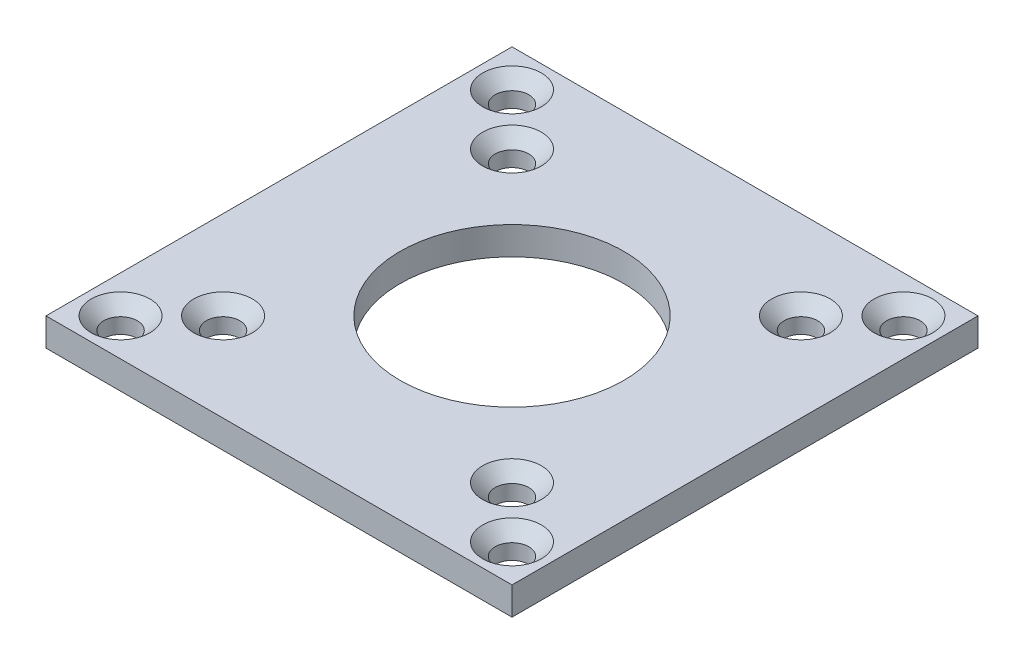
ISO-10303-21;
HEADER;
FILE_DESCRIPTION(('STEP AP214'),'2;1');
FILE_NAME('part.step','',(''),(''),'','','');
FILE_SCHEMA(('AUTOMOTIVE_DESIGN { 1 0 10303 214 1 1 1 1 }'));
ENDSEC;
DATA;
#1=APPLICATION_CONTEXT('core data for automotive mechanical design processes');
#2=APPLICATION_PROTOCOL_DEFINITION('international standard','automotive_design',2000,#1);
#3=PRODUCT_CONTEXT('',#1,'mechanical');
#4=PRODUCT('Part','Part','',(#3));
#5=PRODUCT_RELATED_PRODUCT_CATEGORY('part','',(#4));
#6=PRODUCT_DEFINITION_FORMATION('','',#4);
#7=PRODUCT_DEFINITION_CONTEXT('part definition',#1,'design');
#8=PRODUCT_DEFINITION('design','',#6,#7);
#9=PRODUCT_DEFINITION_SHAPE('','',#8);
#10=(LENGTH_UNIT() NAMED_UNIT(*) SI_UNIT(.MILLI.,.METRE.));
#11=(NAMED_UNIT(*) PLANE_ANGLE_UNIT() SI_UNIT($,.RADIAN.));
#12=(NAMED_UNIT(*) SI_UNIT($,.STERADIAN.) SOLID_ANGLE_UNIT());
#13=UNCERTAINTY_MEASURE_WITH_UNIT(LENGTH_MEASURE(1.E-05),#10,'distance_accuracy_value','');
#14=(GEOMETRIC_REPRESENTATION_CONTEXT(3) GLOBAL_UNCERTAINTY_ASSIGNED_CONTEXT((#13)) GLOBAL_UNIT_ASSIGNED_CONTEXT((#10,
#11,#12)) REPRESENTATION_CONTEXT('',''));
#15=CARTESIAN_POINT('',(0.,0.,0.));
#16=DIRECTION('',(0.,0.,1.));
#17=DIRECTION('',(1.,0.,0.));
#18=AXIS2_PLACEMENT_3D('',#15,#16,#17);
#19=CARTESIAN_POINT('',(-25.,3.,25.));
#20=DIRECTION('',(1.,0.,0.));
#21=DIRECTION('',(0.,0.,-1.));
#22=AXIS2_PLACEMENT_3D('',#19,#20,#21);
#23=PLANE('',#22);
#24=DIRECTION('',(0.,0.,1.));
#25=VECTOR('',#24,1.);
#26=CARTESIAN_POINT('',(-25.,0.,25.));
#27=LINE('',#26,#25);
#28=CARTESIAN_POINT('',(-25.,0.,-25.));
#29=VERTEX_POINT('',#28);
#30=CARTESIAN_POINT('',(-25.,0.,25.));
#31=VERTEX_POINT('',#30);
#32=EDGE_CURVE('E107',#29,#31,#27,.T.);
#33=ORIENTED_EDGE('',*,*,#32,.T.);
#34=DIRECTION('',(0.,-1.,0.));
#35=VECTOR('',#34,1.);
#36=CARTESIAN_POINT('',(-25.,3.,25.));
#37=LINE('',#36,#35);
#38=CARTESIAN_POINT('',(-25.,3.,25.));
#39=VERTEX_POINT('',#38);
#40=EDGE_CURVE('E11',#39,#31,#37,.T.);
#41=ORIENTED_EDGE('',*,*,#40,.F.);
#42=DIRECTION('',(0.,0.,1.));
#43=VECTOR('',#42,1.);
#44=CARTESIAN_POINT('',(-25.,3.,25.));
#45=LINE('',#44,#43);
#46=CARTESIAN_POINT('',(-25.,3.,-25.));
#47=VERTEX_POINT('',#46);
#48=EDGE_CURVE('E91',#47,#39,#45,.T.);
#49=ORIENTED_EDGE('',*,*,#48,.F.);
#50=DIRECTION('',(0.,-1.,0.));
#51=VECTOR('',#50,1.);
#52=CARTESIAN_POINT('',(-25.,3.,-25.));
#53=LINE('',#52,#51);
#54=EDGE_CURVE('E103',#47,#29,#53,.T.);
#55=ORIENTED_EDGE('',*,*,#54,.T.);
#56=EDGE_LOOP('',(#33,#41,#49,#55));
#57=FACE_BOUND('',#56,.T.);
#58=ADVANCED_FACE('F39',(#57),#23,.F.);
#59=CARTESIAN_POINT('',(25.,3.,25.));
#60=DIRECTION('',(0.,0.,-1.));
#61=DIRECTION('',(-1.,0.,0.));
#62=AXIS2_PLACEMENT_3D('',#59,#60,#61);
#63=PLANE('',#62);
#64=DIRECTION('',(1.,0.,0.));
#65=VECTOR('',#64,1.);
#66=CARTESIAN_POINT('',(25.,0.,25.));
#67=LINE('',#66,#65);
#68=CARTESIAN_POINT('',(25.,0.,25.));
#69=VERTEX_POINT('',#68);
#70=EDGE_CURVE('E96',#31,#69,#67,.T.);
#71=ORIENTED_EDGE('',*,*,#70,.T.);
#72=DIRECTION('',(0.,-1.,0.));
#73=VECTOR('',#72,1.);
#74=CARTESIAN_POINT('',(25.,3.,25.));
#75=LINE('',#74,#73);
#76=CARTESIAN_POINT('',(25.,3.,25.));
#77=VERTEX_POINT('',#76);
#78=EDGE_CURVE('E48',#77,#69,#75,.T.);
#79=ORIENTED_EDGE('',*,*,#78,.F.);
#80=DIRECTION('',(1.,0.,0.));
#81=VECTOR('',#80,1.);
#82=CARTESIAN_POINT('',(25.,3.,25.));
#83=LINE('',#82,#81);
#84=EDGE_CURVE('E86',#39,#77,#83,.T.);
#85=ORIENTED_EDGE('',*,*,#84,.F.);
#86=ORIENTED_EDGE('',*,*,#40,.T.);
#87=EDGE_LOOP('',(#71,#79,#85,#86));
#88=FACE_BOUND('',#87,.T.);
#89=ADVANCED_FACE('F95',(#88),#63,.F.);
#90=CARTESIAN_POINT('',(25.,3.,25.));
#91=DIRECTION('',(-1.,0.,0.));
#92=DIRECTION('',(0.,0.,1.));
#93=AXIS2_PLACEMENT_3D('',#90,#91,#92);
#94=PLANE('',#93);
#95=DIRECTION('',(0.,0.,-1.));
#96=VECTOR('',#95,1.);
#97=CARTESIAN_POINT('',(25.,0.,25.));
#98=LINE('',#97,#96);
#99=CARTESIAN_POINT('',(25.,0.,-25.));
#100=VERTEX_POINT('',#99);
#101=EDGE_CURVE('E73',#69,#100,#98,.T.);
#102=ORIENTED_EDGE('',*,*,#101,.T.);
#103=DIRECTION('',(0.,-1.,0.));
#104=VECTOR('',#103,1.);
#105=CARTESIAN_POINT('',(25.,3.,-25.));
#106=LINE('',#105,#104);
#107=CARTESIAN_POINT('',(25.,3.,-25.));
#108=VERTEX_POINT('',#107);
#109=EDGE_CURVE('E98',#108,#100,#106,.T.);
#110=ORIENTED_EDGE('',*,*,#109,.F.);
#111=DIRECTION('',(0.,0.,-1.));
#112=VECTOR('',#111,1.);
#113=CARTESIAN_POINT('',(25.,3.,25.));
#114=LINE('',#113,#112);
#115=EDGE_CURVE('E89',#77,#108,#114,.T.);
#116=ORIENTED_EDGE('',*,*,#115,.F.);
#117=ORIENTED_EDGE('',*,*,#78,.T.);
#118=EDGE_LOOP('',(#102,#110,#116,#117));
#119=FACE_BOUND('',#118,.T.);
#120=ADVANCED_FACE('F99',(#119),#94,.F.);
#121=CARTESIAN_POINT('',(25.,3.,-25.));
#122=DIRECTION('',(0.,0.,1.));
#123=DIRECTION('',(1.,0.,0.));
#124=AXIS2_PLACEMENT_3D('',#121,#122,#123);
#125=PLANE('',#124);
#126=DIRECTION('',(-1.,0.,0.));
#127=VECTOR('',#126,1.);
#128=CARTESIAN_POINT('',(25.,0.,-25.));
#129=LINE('',#128,#127);
#130=EDGE_CURVE('E79',#100,#29,#129,.T.);
#131=ORIENTED_EDGE('',*,*,#130,.T.);
#132=ORIENTED_EDGE('',*,*,#54,.F.);
#133=DIRECTION('',(-1.,0.,0.));
#134=VECTOR('',#133,1.);
#135=CARTESIAN_POINT('',(25.,3.,-25.));
#136=LINE('',#135,#134);
#137=EDGE_CURVE('E56',#108,#47,#136,.T.);
#138=ORIENTED_EDGE('',*,*,#137,.F.);
#139=ORIENTED_EDGE('',*,*,#109,.T.);
#140=EDGE_LOOP('',(#131,#132,#138,#139));
#141=FACE_BOUND('',#140,.T.);
#142=ADVANCED_FACE('F121',(#141),#125,.F.);
#143=CARTESIAN_POINT('',(0.,3.,0.));
#144=DIRECTION('',(0.,1.,0.));
#145=DIRECTION('',(0.,0.,1.));
#146=AXIS2_PLACEMENT_3D('',#143,#144,#145);
#147=PLANE('',#146);
#148=CARTESIAN_POINT('',(-15.5,3.,-15.5000000000001));
#149=DIRECTION('',(0.,1.,0.));
#150=DIRECTION('',(0.,0.,1.));
#151=AXIS2_PLACEMENT_3D('',#148,#149,#150);
#152=CIRCLE('',#151,3.15);
#153=CARTESIAN_POINT('',(-15.5,3.,-12.3500000000001));
#154=VERTEX_POINT('',#153);
#155=EDGE_CURVE('E227',#154,#154,#152,.T.);
#156=ORIENTED_EDGE('',*,*,#155,.F.);
#157=EDGE_LOOP('',(#156));
#158=FACE_BOUND('',#157,.T.);
#159=CARTESIAN_POINT('',(15.4999999999999,3.,-15.5000000000001));
#160=DIRECTION('',(0.,1.,0.));
#161=DIRECTION('',(0.,0.,1.));
#162=AXIS2_PLACEMENT_3D('',#159,#160,#161);
#163=CIRCLE('',#162,3.15);
#164=CARTESIAN_POINT('',(15.4999999999999,3.,-12.3500000000001));
#165=VERTEX_POINT('',#164);
#166=EDGE_CURVE('E215',#165,#165,#163,.T.);
#167=ORIENTED_EDGE('',*,*,#166,.F.);
#168=EDGE_LOOP('',(#167));
#169=FACE_BOUND('',#168,.T.);
#170=CARTESIAN_POINT('',(15.4999999999999,3.,15.4999999999999));
#171=DIRECTION('',(0.,1.,0.));
#172=DIRECTION('',(0.,0.,1.));
#173=AXIS2_PLACEMENT_3D('',#170,#171,#172);
#174=CIRCLE('',#173,3.15);
#175=CARTESIAN_POINT('',(15.4999999999999,3.,18.6499999999999));
#176=VERTEX_POINT('',#175);
#177=EDGE_CURVE('E203',#176,#176,#174,.T.);
#178=ORIENTED_EDGE('',*,*,#177,.F.);
#179=EDGE_LOOP('',(#178));
#180=FACE_BOUND('',#179,.T.);
#181=CARTESIAN_POINT('',(-15.5,3.,15.4999999999999));
#182=DIRECTION('',(0.,1.,0.));
#183=DIRECTION('',(0.,0.,1.));
#184=AXIS2_PLACEMENT_3D('',#181,#182,#183);
#185=CIRCLE('',#184,3.15);
#186=CARTESIAN_POINT('',(-15.5,3.,18.6499999999999));
#187=VERTEX_POINT('',#186);
#188=EDGE_CURVE('E191',#187,#187,#185,.T.);
#189=ORIENTED_EDGE('',*,*,#188,.F.);
#190=EDGE_LOOP('',(#189));
#191=FACE_BOUND('',#190,.T.);
#192=CARTESIAN_POINT('',(0.,3.,0.));
#193=DIRECTION('',(0.,1.,0.));
#194=DIRECTION('',(0.,0.,1.));
#195=AXIS2_PLACEMENT_3D('',#192,#193,#194);
#196=CIRCLE('',#195,12.);
#197=CARTESIAN_POINT('',(0.,3.,12.));
#198=VERTEX_POINT('',#197);
#199=EDGE_CURVE('E179',#198,#198,#196,.T.);
#200=ORIENTED_EDGE('',*,*,#199,.F.);
#201=EDGE_LOOP('',(#200));
#202=FACE_BOUND('',#201,.T.);
#203=CARTESIAN_POINT('',(-21.,3.,21.));
#204=DIRECTION('',(0.,1.,0.));
#205=DIRECTION('',(0.,0.,1.));
#206=AXIS2_PLACEMENT_3D('',#203,#204,#205);
#207=CIRCLE('',#206,3.15);
#208=CARTESIAN_POINT('',(-21.,3.,24.15));
#209=VERTEX_POINT('',#208);
#210=EDGE_CURVE('E171',#209,#209,#207,.T.);
#211=ORIENTED_EDGE('',*,*,#210,.F.);
#212=EDGE_LOOP('',(#211));
#213=FACE_BOUND('',#212,.T.);
#214=CARTESIAN_POINT('',(-21.,3.,-21.));
#215=DIRECTION('',(0.,1.,0.));
#216=DIRECTION('',(0.,0.,1.));
#217=AXIS2_PLACEMENT_3D('',#214,#215,#216);
#218=CIRCLE('',#217,3.15);
#219=CARTESIAN_POINT('',(-21.,3.,-17.85));
#220=VERTEX_POINT('',#219);
#221=EDGE_CURVE('E159',#220,#220,#218,.T.);
#222=ORIENTED_EDGE('',*,*,#221,.F.);
#223=EDGE_LOOP('',(#222));
#224=FACE_BOUND('',#223,.T.);
#225=CARTESIAN_POINT('',(21.,3.,-21.));
#226=DIRECTION('',(0.,1.,0.));
#227=DIRECTION('',(0.,0.,1.));
#228=AXIS2_PLACEMENT_3D('',#225,#226,#227);
#229=CIRCLE('',#228,3.15);
#230=CARTESIAN_POINT('',(21.,3.,-17.85));
#231=VERTEX_POINT('',#230);
#232=EDGE_CURVE('E147',#231,#231,#229,.T.);
#233=ORIENTED_EDGE('',*,*,#232,.F.);
#234=EDGE_LOOP('',(#233));
#235=FACE_BOUND('',#234,.T.);
#236=CARTESIAN_POINT('',(21.,3.,21.));
#237=DIRECTION('',(0.,1.,0.));
#238=DIRECTION('',(0.,0.,1.));
#239=AXIS2_PLACEMENT_3D('',#236,#237,#238);
#240=CIRCLE('',#239,3.15);
#241=CARTESIAN_POINT('',(21.,3.,24.15));
#242=VERTEX_POINT('',#241);
#243=EDGE_CURVE('E135',#242,#242,#240,.T.);
#244=ORIENTED_EDGE('',*,*,#243,.F.);
#245=EDGE_LOOP('',(#244));
#246=FACE_BOUND('',#245,.T.);
#247=ORIENTED_EDGE('',*,*,#48,.T.);
#248=ORIENTED_EDGE('',*,*,#84,.T.);
#249=ORIENTED_EDGE('',*,*,#115,.T.);
#250=ORIENTED_EDGE('',*,*,#137,.T.);
#251=EDGE_LOOP('',(#247,#248,#249,#250));
#252=FACE_BOUND('',#251,.T.);
#253=ADVANCED_FACE('F87',(#158,#169,#180,#191,#202,#213,#224,#235,#246,#252),#147,.T.);
#254=CARTESIAN_POINT('',(0.,0.,0.));
#255=DIRECTION('',(0.,1.,0.));
#256=DIRECTION('',(0.,0.,1.));
#257=AXIS2_PLACEMENT_3D('',#254,#255,#256);
#258=PLANE('',#257);
#259=CARTESIAN_POINT('',(-15.5,0.,-15.5000000000001));
#260=DIRECTION('',(0.,1.,0.));
#261=DIRECTION('',(0.,0.,1.));
#262=AXIS2_PLACEMENT_3D('',#259,#260,#261);
#263=CIRCLE('',#262,1.79999999999999);
#264=CARTESIAN_POINT('',(-15.5,0.,-13.7000000000001));
#265=VERTEX_POINT('',#264);
#266=EDGE_CURVE('E219',#265,#265,#263,.T.);
#267=ORIENTED_EDGE('',*,*,#266,.T.);
#268=EDGE_LOOP('',(#267));
#269=FACE_BOUND('',#268,.T.);
#270=CARTESIAN_POINT('',(15.4999999999999,0.,-15.5000000000001));
#271=DIRECTION('',(0.,1.,0.));
#272=DIRECTION('',(0.,0.,1.));
#273=AXIS2_PLACEMENT_3D('',#270,#271,#272);
#274=CIRCLE('',#273,1.79999999999999);
#275=CARTESIAN_POINT('',(15.4999999999999,0.,-13.7000000000001));
#276=VERTEX_POINT('',#275);
#277=EDGE_CURVE('E207',#276,#276,#274,.T.);
#278=ORIENTED_EDGE('',*,*,#277,.T.);
#279=EDGE_LOOP('',(#278));
#280=FACE_BOUND('',#279,.T.);
#281=CARTESIAN_POINT('',(15.4999999999999,0.,15.4999999999999));
#282=DIRECTION('',(0.,1.,0.));
#283=DIRECTION('',(0.,0.,1.));
#284=AXIS2_PLACEMENT_3D('',#281,#282,#283);
#285=CIRCLE('',#284,1.79999999999999);
#286=CARTESIAN_POINT('',(15.4999999999999,0.,17.2999999999999));
#287=VERTEX_POINT('',#286);
#288=EDGE_CURVE('E195',#287,#287,#285,.T.);
#289=ORIENTED_EDGE('',*,*,#288,.T.);
#290=EDGE_LOOP('',(#289));
#291=FACE_BOUND('',#290,.T.);
#292=CARTESIAN_POINT('',(-15.5,0.,15.4999999999999));
#293=DIRECTION('',(0.,1.,0.));
#294=DIRECTION('',(0.,0.,1.));
#295=AXIS2_PLACEMENT_3D('',#292,#293,#294);
#296=CIRCLE('',#295,1.79999999999999);
#297=CARTESIAN_POINT('',(-15.5,0.,17.2999999999999));
#298=VERTEX_POINT('',#297);
#299=EDGE_CURVE('E183',#298,#298,#296,.T.);
#300=ORIENTED_EDGE('',*,*,#299,.T.);
#301=EDGE_LOOP('',(#300));
#302=FACE_BOUND('',#301,.T.);
#303=CARTESIAN_POINT('',(0.,0.,0.));
#304=DIRECTION('',(0.,1.,0.));
#305=DIRECTION('',(0.,0.,1.));
#306=AXIS2_PLACEMENT_3D('',#303,#304,#305);
#307=CIRCLE('',#306,12.);
#308=CARTESIAN_POINT('',(0.,0.,12.));
#309=VERTEX_POINT('',#308);
#310=EDGE_CURVE('E175',#309,#309,#307,.T.);
#311=ORIENTED_EDGE('',*,*,#310,.T.);
#312=EDGE_LOOP('',(#311));
#313=FACE_BOUND('',#312,.T.);
#314=CARTESIAN_POINT('',(-21.,0.,21.));
#315=DIRECTION('',(0.,1.,0.));
#316=DIRECTION('',(0.,0.,1.));
#317=AXIS2_PLACEMENT_3D('',#314,#315,#316);
#318=CIRCLE('',#317,1.8);
#319=CARTESIAN_POINT('',(-21.,0.,22.8));
#320=VERTEX_POINT('',#319);
#321=EDGE_CURVE('E163',#320,#320,#318,.T.);
#322=ORIENTED_EDGE('',*,*,#321,.T.);
#323=EDGE_LOOP('',(#322));
#324=FACE_BOUND('',#323,.T.);
#325=CARTESIAN_POINT('',(-21.,0.,-21.));
#326=DIRECTION('',(0.,1.,0.));
#327=DIRECTION('',(0.,0.,1.));
#328=AXIS2_PLACEMENT_3D('',#325,#326,#327);
#329=CIRCLE('',#328,1.8);
#330=CARTESIAN_POINT('',(-21.,0.,-19.2));
#331=VERTEX_POINT('',#330);
#332=EDGE_CURVE('E151',#331,#331,#329,.T.);
#333=ORIENTED_EDGE('',*,*,#332,.T.);
#334=EDGE_LOOP('',(#333));
#335=FACE_BOUND('',#334,.T.);
#336=CARTESIAN_POINT('',(21.,0.,-21.));
#337=DIRECTION('',(0.,1.,0.));
#338=DIRECTION('',(0.,0.,1.));
#339=AXIS2_PLACEMENT_3D('',#336,#337,#338);
#340=CIRCLE('',#339,1.8);
#341=CARTESIAN_POINT('',(21.,0.,-19.2));
#342=VERTEX_POINT('',#341);
#343=EDGE_CURVE('E139',#342,#342,#340,.T.);
#344=ORIENTED_EDGE('',*,*,#343,.T.);
#345=EDGE_LOOP('',(#344));
#346=FACE_BOUND('',#345,.T.);
#347=CARTESIAN_POINT('',(21.,0.,21.));
#348=DIRECTION('',(0.,1.,0.));
#349=DIRECTION('',(0.,0.,1.));
#350=AXIS2_PLACEMENT_3D('',#347,#348,#349);
#351=CIRCLE('',#350,1.8);
#352=CARTESIAN_POINT('',(21.,0.,22.8));
#353=VERTEX_POINT('',#352);
#354=EDGE_CURVE('E111',#353,#353,#351,.T.);
#355=ORIENTED_EDGE('',*,*,#354,.T.);
#356=EDGE_LOOP('',(#355));
#357=FACE_BOUND('',#356,.T.);
#358=ORIENTED_EDGE('',*,*,#32,.F.);
#359=ORIENTED_EDGE('',*,*,#130,.F.);
#360=ORIENTED_EDGE('',*,*,#101,.F.);
#361=ORIENTED_EDGE('',*,*,#70,.F.);
#362=EDGE_LOOP('',(#358,#359,#360,#361));
#363=FACE_BOUND('',#362,.T.);
#364=ADVANCED_FACE('F124',(#269,#280,#291,#302,#313,#324,#335,#346,#357,#363),#258,.F.);
#365=CARTESIAN_POINT('',(21.,3.,21.));
#366=DIRECTION('',(0.,1.,0.));
#367=DIRECTION('',(0.,0.,1.));
#368=AXIS2_PLACEMENT_3D('',#365,#366,#367);
#369=CYLINDRICAL_SURFACE('',#368,1.8);
#370=ORIENTED_EDGE('',*,*,#354,.F.);
#371=EDGE_LOOP('',(#370));
#372=FACE_BOUND('',#371,.T.);
#373=CARTESIAN_POINT('',(21.,1.65,21.));
#374=DIRECTION('',(0.,1.,0.));
#375=DIRECTION('',(0.,0.,1.));
#376=AXIS2_PLACEMENT_3D('',#373,#374,#375);
#377=CIRCLE('',#376,1.8);
#378=CARTESIAN_POINT('',(21.,1.65,22.8));
#379=VERTEX_POINT('',#378);
#380=EDGE_CURVE('E131',#379,#379,#377,.T.);
#381=ORIENTED_EDGE('',*,*,#380,.T.);
#382=EDGE_LOOP('',(#381));
#383=FACE_BOUND('',#382,.T.);
#384=ADVANCED_FACE('F256',(#372,#383),#369,.F.);
#385=CARTESIAN_POINT('',(21.,3.,21.));
#386=DIRECTION('',(0.,1.,0.));
#387=DIRECTION('',(0.,0.,1.));
#388=AXIS2_PLACEMENT_3D('',#385,#386,#387);
#389=CONICAL_SURFACE('',#388,3.15,0.785398163397448);
#390=ORIENTED_EDGE('',*,*,#380,.F.);
#391=EDGE_LOOP('',(#390));
#392=FACE_BOUND('',#391,.T.);
#393=ORIENTED_EDGE('',*,*,#243,.T.);
#394=EDGE_LOOP('',(#393));
#395=FACE_BOUND('',#394,.T.);
#396=ADVANCED_FACE('F253',(#392,#395),#389,.F.);
#397=CARTESIAN_POINT('',(21.,3.,-21.));
#398=DIRECTION('',(0.,1.,0.));
#399=DIRECTION('',(0.,0.,1.));
#400=AXIS2_PLACEMENT_3D('',#397,#398,#399);
#401=CYLINDRICAL_SURFACE('',#400,1.8);
#402=ORIENTED_EDGE('',*,*,#343,.F.);
#403=EDGE_LOOP('',(#402));
#404=FACE_BOUND('',#403,.T.);
#405=CARTESIAN_POINT('',(21.,1.65,-21.));
#406=DIRECTION('',(0.,1.,0.));
#407=DIRECTION('',(0.,0.,1.));
#408=AXIS2_PLACEMENT_3D('',#405,#406,#407);
#409=CIRCLE('',#408,1.8);
#410=CARTESIAN_POINT('',(21.,1.65,-19.2));
#411=VERTEX_POINT('',#410);
#412=EDGE_CURVE('E143',#411,#411,#409,.T.);
#413=ORIENTED_EDGE('',*,*,#412,.T.);
#414=EDGE_LOOP('',(#413));
#415=FACE_BOUND('',#414,.T.);
#416=ADVANCED_FACE('F255',(#404,#415),#401,.F.);
#417=CARTESIAN_POINT('',(21.,3.,-21.));
#418=DIRECTION('',(0.,1.,0.));
#419=DIRECTION('',(0.,0.,1.));
#420=AXIS2_PLACEMENT_3D('',#417,#418,#419);
#421=CONICAL_SURFACE('',#420,3.15,0.785398163397448);
#422=ORIENTED_EDGE('',*,*,#412,.F.);
#423=EDGE_LOOP('',(#422));
#424=FACE_BOUND('',#423,.T.);
#425=ORIENTED_EDGE('',*,*,#232,.T.);
#426=EDGE_LOOP('',(#425));
#427=FACE_BOUND('',#426,.T.);
#428=ADVANCED_FACE('F263',(#424,#427),#421,.F.);
#429=CARTESIAN_POINT('',(-21.,3.,-21.));
#430=DIRECTION('',(0.,1.,0.));
#431=DIRECTION('',(0.,0.,1.));
#432=AXIS2_PLACEMENT_3D('',#429,#430,#431);
#433=CYLINDRICAL_SURFACE('',#432,1.8);
#434=ORIENTED_EDGE('',*,*,#332,.F.);
#435=EDGE_LOOP('',(#434));
#436=FACE_BOUND('',#435,.T.);
#437=CARTESIAN_POINT('',(-21.,1.65,-21.));
#438=DIRECTION('',(0.,1.,0.));
#439=DIRECTION('',(0.,0.,1.));
#440=AXIS2_PLACEMENT_3D('',#437,#438,#439);
#441=CIRCLE('',#440,1.8);
#442=CARTESIAN_POINT('',(-21.,1.65,-19.2));
#443=VERTEX_POINT('',#442);
#444=EDGE_CURVE('E155',#443,#443,#441,.T.);
#445=ORIENTED_EDGE('',*,*,#444,.T.);
#446=EDGE_LOOP('',(#445));
#447=FACE_BOUND('',#446,.T.);
#448=ADVANCED_FACE('F307',(#436,#447),#433,.F.);
#449=CARTESIAN_POINT('',(-21.,3.,-21.));
#450=DIRECTION('',(0.,1.,0.));
#451=DIRECTION('',(0.,0.,1.));
#452=AXIS2_PLACEMENT_3D('',#449,#450,#451);
#453=CONICAL_SURFACE('',#452,3.15,0.785398163397448);
#454=ORIENTED_EDGE('',*,*,#444,.F.);
#455=EDGE_LOOP('',(#454));
#456=FACE_BOUND('',#455,.T.);
#457=ORIENTED_EDGE('',*,*,#221,.T.);
#458=EDGE_LOOP('',(#457));
#459=FACE_BOUND('',#458,.T.);
#460=ADVANCED_FACE('F312',(#456,#459),#453,.F.);
#461=CARTESIAN_POINT('',(-21.,3.,21.));
#462=DIRECTION('',(0.,1.,0.));
#463=DIRECTION('',(0.,0.,1.));
#464=AXIS2_PLACEMENT_3D('',#461,#462,#463);
#465=CYLINDRICAL_SURFACE('',#464,1.8);
#466=ORIENTED_EDGE('',*,*,#321,.F.);
#467=EDGE_LOOP('',(#466));
#468=FACE_BOUND('',#467,.T.);
#469=CARTESIAN_POINT('',(-21.,1.65,21.));
#470=DIRECTION('',(0.,1.,0.));
#471=DIRECTION('',(0.,0.,1.));
#472=AXIS2_PLACEMENT_3D('',#469,#470,#471);
#473=CIRCLE('',#472,1.8);
#474=CARTESIAN_POINT('',(-21.,1.65,22.8));
#475=VERTEX_POINT('',#474);
#476=EDGE_CURVE('E167',#475,#475,#473,.T.);
#477=ORIENTED_EDGE('',*,*,#476,.T.);
#478=EDGE_LOOP('',(#477));
#479=FACE_BOUND('',#478,.T.);
#480=ADVANCED_FACE('F318',(#468,#479),#465,.F.);
#481=CARTESIAN_POINT('',(-21.,3.,21.));
#482=DIRECTION('',(0.,1.,0.));
#483=DIRECTION('',(0.,0.,1.));
#484=AXIS2_PLACEMENT_3D('',#481,#482,#483);
#485=CONICAL_SURFACE('',#484,3.15,0.785398163397448);
#486=ORIENTED_EDGE('',*,*,#476,.F.);
#487=EDGE_LOOP('',(#486));
#488=FACE_BOUND('',#487,.T.);
#489=ORIENTED_EDGE('',*,*,#210,.T.);
#490=EDGE_LOOP('',(#489));
#491=FACE_BOUND('',#490,.T.);
#492=ADVANCED_FACE('F322',(#488,#491),#485,.F.);
#493=CARTESIAN_POINT('',(0.,3.,0.));
#494=DIRECTION('',(0.,1.,0.));
#495=DIRECTION('',(0.,0.,1.));
#496=AXIS2_PLACEMENT_3D('',#493,#494,#495);
#497=CYLINDRICAL_SURFACE('',#496,12.);
#498=ORIENTED_EDGE('',*,*,#310,.F.);
#499=EDGE_LOOP('',(#498));
#500=FACE_BOUND('',#499,.T.);
#501=ORIENTED_EDGE('',*,*,#199,.T.);
#502=EDGE_LOOP('',(#501));
#503=FACE_BOUND('',#502,.T.);
#504=ADVANCED_FACE('F326',(#500,#503),#497,.F.);
#505=CARTESIAN_POINT('',(-15.5,3.,15.4999999999999));
#506=DIRECTION('',(0.,1.,0.));
#507=DIRECTION('',(0.,0.,1.));
#508=AXIS2_PLACEMENT_3D('',#505,#506,#507);
#509=CYLINDRICAL_SURFACE('',#508,1.79999999999999);
#510=ORIENTED_EDGE('',*,*,#299,.F.);
#511=EDGE_LOOP('',(#510));
#512=FACE_BOUND('',#511,.T.);
#513=CARTESIAN_POINT('',(-15.5,1.65,15.4999999999999));
#514=DIRECTION('',(0.,1.,0.));
#515=DIRECTION('',(0.,0.,1.));
#516=AXIS2_PLACEMENT_3D('',#513,#514,#515);
#517=CIRCLE('',#516,1.8);
#518=CARTESIAN_POINT('',(-15.5,1.65,17.2999999999999));
#519=VERTEX_POINT('',#518);
#520=EDGE_CURVE('E187',#519,#519,#517,.T.);
#521=ORIENTED_EDGE('',*,*,#520,.T.);
#522=EDGE_LOOP('',(#521));
#523=FACE_BOUND('',#522,.T.);
#524=ADVANCED_FACE('F330',(#512,#523),#509,.F.);
#525=CARTESIAN_POINT('',(-15.5,3.,15.4999999999999));
#526=DIRECTION('',(0.,1.,0.));
#527=DIRECTION('',(0.,0.,1.));
#528=AXIS2_PLACEMENT_3D('',#525,#526,#527);
#529=CONICAL_SURFACE('',#528,3.15,0.785398163397447);
#530=ORIENTED_EDGE('',*,*,#520,.F.);
#531=EDGE_LOOP('',(#530));
#532=FACE_BOUND('',#531,.T.);
#533=ORIENTED_EDGE('',*,*,#188,.T.);
#534=EDGE_LOOP('',(#533));
#535=FACE_BOUND('',#534,.T.);
#536=ADVANCED_FACE('F334',(#532,#535),#529,.F.);
#537=CARTESIAN_POINT('',(15.4999999999999,3.,15.4999999999999));
#538=DIRECTION('',(0.,1.,0.));
#539=DIRECTION('',(0.,0.,1.));
#540=AXIS2_PLACEMENT_3D('',#537,#538,#539);
#541=CYLINDRICAL_SURFACE('',#540,1.79999999999999);
#542=ORIENTED_EDGE('',*,*,#288,.F.);
#543=EDGE_LOOP('',(#542));
#544=FACE_BOUND('',#543,.T.);
#545=CARTESIAN_POINT('',(15.4999999999999,1.65,15.4999999999999));
#546=DIRECTION('',(0.,1.,0.));
#547=DIRECTION('',(0.,0.,1.));
#548=AXIS2_PLACEMENT_3D('',#545,#546,#547);
#549=CIRCLE('',#548,1.8);
#550=CARTESIAN_POINT('',(15.4999999999999,1.65,17.2999999999999));
#551=VERTEX_POINT('',#550);
#552=EDGE_CURVE('E199',#551,#551,#549,.T.);
#553=ORIENTED_EDGE('',*,*,#552,.T.);
#554=EDGE_LOOP('',(#553));
#555=FACE_BOUND('',#554,.T.);
#556=ADVANCED_FACE('F338',(#544,#555),#541,.F.);
#557=CARTESIAN_POINT('',(15.4999999999999,3.,15.4999999999999));
#558=DIRECTION('',(0.,1.,0.));
#559=DIRECTION('',(0.,0.,1.));
#560=AXIS2_PLACEMENT_3D('',#557,#558,#559);
#561=CONICAL_SURFACE('',#560,3.15,0.785398163397447);
#562=ORIENTED_EDGE('',*,*,#552,.F.);
#563=EDGE_LOOP('',(#562));
#564=FACE_BOUND('',#563,.T.);
#565=ORIENTED_EDGE('',*,*,#177,.T.);
#566=EDGE_LOOP('',(#565));
#567=FACE_BOUND('',#566,.T.);
#568=ADVANCED_FACE('F342',(#564,#567),#561,.F.);
#569=CARTESIAN_POINT('',(15.4999999999999,3.,-15.5000000000001));
#570=DIRECTION('',(0.,1.,0.));
#571=DIRECTION('',(0.,0.,1.));
#572=AXIS2_PLACEMENT_3D('',#569,#570,#571);
#573=CYLINDRICAL_SURFACE('',#572,1.79999999999999);
#574=ORIENTED_EDGE('',*,*,#277,.F.);
#575=EDGE_LOOP('',(#574));
#576=FACE_BOUND('',#575,.T.);
#577=CARTESIAN_POINT('',(15.4999999999999,1.65,-15.5000000000001));
#578=DIRECTION('',(0.,1.,0.));
#579=DIRECTION('',(0.,0.,1.));
#580=AXIS2_PLACEMENT_3D('',#577,#578,#579);
#581=CIRCLE('',#580,1.8);
#582=CARTESIAN_POINT('',(15.4999999999999,1.65,-13.7000000000001));
#583=VERTEX_POINT('',#582);
#584=EDGE_CURVE('E211',#583,#583,#581,.T.);
#585=ORIENTED_EDGE('',*,*,#584,.T.);
#586=EDGE_LOOP('',(#585));
#587=FACE_BOUND('',#586,.T.);
#588=ADVANCED_FACE('F346',(#576,#587),#573,.F.);
#589=CARTESIAN_POINT('',(15.4999999999999,3.,-15.5000000000001));
#590=DIRECTION('',(0.,1.,0.));
#591=DIRECTION('',(0.,0.,1.));
#592=AXIS2_PLACEMENT_3D('',#589,#590,#591);
#593=CONICAL_SURFACE('',#592,3.15,0.785398163397447);
#594=ORIENTED_EDGE('',*,*,#584,.F.);
#595=EDGE_LOOP('',(#594));
#596=FACE_BOUND('',#595,.T.);
#597=ORIENTED_EDGE('',*,*,#166,.T.);
#598=EDGE_LOOP('',(#597));
#599=FACE_BOUND('',#598,.T.);
#600=ADVANCED_FACE('F350',(#596,#599),#593,.F.);
#601=CARTESIAN_POINT('',(-15.5,3.,-15.5000000000001));
#602=DIRECTION('',(0.,1.,0.));
#603=DIRECTION('',(0.,0.,1.));
#604=AXIS2_PLACEMENT_3D('',#601,#602,#603);
#605=CYLINDRICAL_SURFACE('',#604,1.79999999999999);
#606=ORIENTED_EDGE('',*,*,#266,.F.);
#607=EDGE_LOOP('',(#606));
#608=FACE_BOUND('',#607,.T.);
#609=CARTESIAN_POINT('',(-15.5,1.65,-15.5000000000001));
#610=DIRECTION('',(0.,1.,0.));
#611=DIRECTION('',(0.,0.,1.));
#612=AXIS2_PLACEMENT_3D('',#609,#610,#611);
#613=CIRCLE('',#612,1.8);
#614=CARTESIAN_POINT('',(-15.5,1.65,-13.7000000000001));
#615=VERTEX_POINT('',#614);
#616=EDGE_CURVE('E223',#615,#615,#613,.T.);
#617=ORIENTED_EDGE('',*,*,#616,.T.);
#618=EDGE_LOOP('',(#617));
#619=FACE_BOUND('',#618,.T.);
#620=ADVANCED_FACE('F354',(#608,#619),#605,.F.);
#621=CARTESIAN_POINT('',(-15.5,3.,-15.5000000000001));
#622=DIRECTION('',(0.,1.,0.));
#623=DIRECTION('',(0.,0.,1.));
#624=AXIS2_PLACEMENT_3D('',#621,#622,#623);
#625=CONICAL_SURFACE('',#624,3.15,0.785398163397447);
#626=ORIENTED_EDGE('',*,*,#616,.F.);
#627=EDGE_LOOP('',(#626));
#628=FACE_BOUND('',#627,.T.);
#629=ORIENTED_EDGE('',*,*,#155,.T.);
#630=EDGE_LOOP('',(#629));
#631=FACE_BOUND('',#630,.T.);
#632=ADVANCED_FACE('F232',(#628,#631),#625,.F.);
#633=CLOSED_SHELL('',(#58,#89,#120,#142,#253,#364,#384,#396,#416,#428,#448,#460,#480,#492,#504,
#524,#536,#556,#568,#588,#600,#620,#632));
#634=MANIFOLD_SOLID_BREP('B2',#633);
#635=ADVANCED_BREP_SHAPE_REPRESENTATION('',(#18,#634),#14);
#636=SHAPE_DEFINITION_REPRESENTATION(#9,#635);
ENDSEC;
END-ISO-10303-21;
